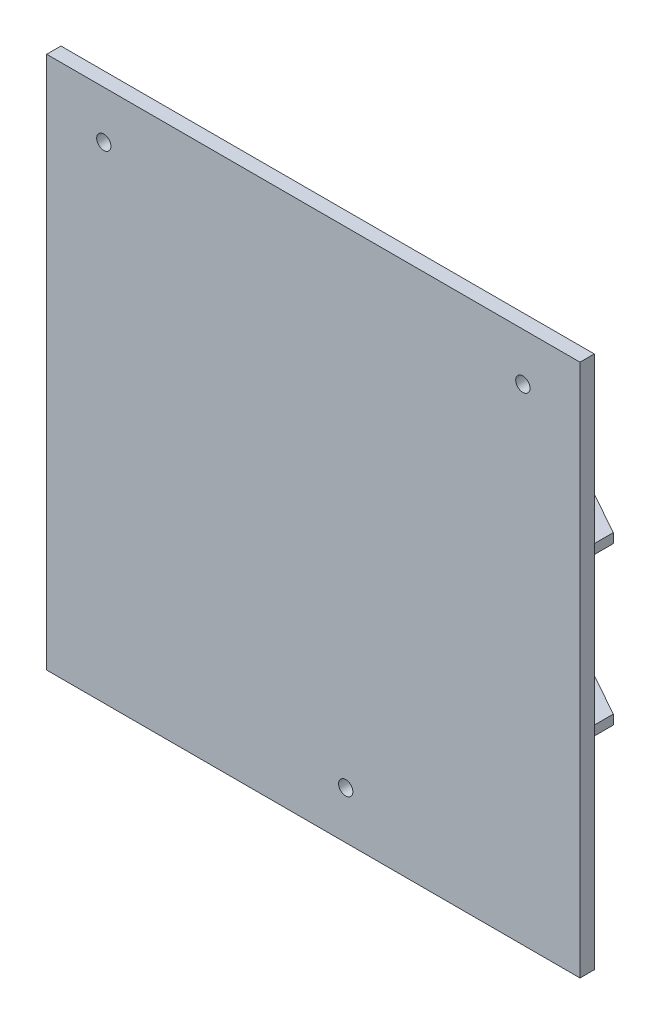
ISO-10303-21;
HEADER;
FILE_DESCRIPTION(('STEP AP214'),'2;1');
FILE_NAME('part.step','',(''),(''),'','','');
FILE_SCHEMA(('AUTOMOTIVE_DESIGN { 1 0 10303 214 1 1 1 1 }'));
ENDSEC;
DATA;
#1=APPLICATION_CONTEXT('core data for automotive mechanical design processes');
#2=APPLICATION_PROTOCOL_DEFINITION('international standard','automotive_design',2000,#1);
#3=PRODUCT_CONTEXT('',#1,'mechanical');
#4=PRODUCT('Part','Part','',(#3));
#5=PRODUCT_RELATED_PRODUCT_CATEGORY('part','',(#4));
#6=PRODUCT_DEFINITION_FORMATION('','',#4);
#7=PRODUCT_DEFINITION_CONTEXT('part definition',#1,'design');
#8=PRODUCT_DEFINITION('design','',#6,#7);
#9=PRODUCT_DEFINITION_SHAPE('','',#8);
#10=(LENGTH_UNIT() NAMED_UNIT(*) SI_UNIT(.MILLI.,.METRE.));
#11=(NAMED_UNIT(*) PLANE_ANGLE_UNIT() SI_UNIT($,.RADIAN.));
#12=(NAMED_UNIT(*) SI_UNIT($,.STERADIAN.) SOLID_ANGLE_UNIT());
#13=UNCERTAINTY_MEASURE_WITH_UNIT(LENGTH_MEASURE(1.E-05),#10,'distance_accuracy_value','');
#14=(GEOMETRIC_REPRESENTATION_CONTEXT(3) GLOBAL_UNCERTAINTY_ASSIGNED_CONTEXT((#13)) GLOBAL_UNIT_ASSIGNED_CONTEXT((#10,
#11,#12)) REPRESENTATION_CONTEXT('',''));
#15=CARTESIAN_POINT('',(0.,0.,0.));
#16=DIRECTION('',(0.,0.,1.));
#17=DIRECTION('',(1.,0.,0.));
#18=AXIS2_PLACEMENT_3D('',#15,#16,#17);
#19=CARTESIAN_POINT('',(0.,0.,-3.));
#20=DIRECTION('',(0.,0.,1.));
#21=DIRECTION('',(-1.,0.,0.));
#22=AXIS2_PLACEMENT_3D('',#19,#20,#21);
#23=PLANE('',#22);
#24=DIRECTION('',(0.,-1.,0.));
#25=VECTOR('',#24,1.);
#26=CARTESIAN_POINT('',(-49.1967650273224,-56.,-3.));
#27=LINE('',#26,#25);
#28=CARTESIAN_POINT('',(-49.1967650273224,-16.,-3.));
#29=VERTEX_POINT('',#28);
#30=CARTESIAN_POINT('',(-49.1967650273224,-56.,-3.));
#31=VERTEX_POINT('',#30);
#32=EDGE_CURVE('E188',#29,#31,#27,.T.);
#33=ORIENTED_EDGE('',*,*,#32,.T.);
#34=DIRECTION('',(1.,0.,0.));
#35=VECTOR('',#34,1.);
#36=CARTESIAN_POINT('',(-56.,-56.,-3.));
#37=LINE('',#36,#35);
#38=CARTESIAN_POINT('',(-56.,-56.,-3.));
#39=VERTEX_POINT('',#38);
#40=EDGE_CURVE('E238',#39,#31,#37,.T.);
#41=ORIENTED_EDGE('',*,*,#40,.F.);
#42=DIRECTION('',(0.,-1.,0.));
#43=VECTOR('',#42,1.);
#44=CARTESIAN_POINT('',(-56.,-56.,-3.));
#45=LINE('',#44,#43);
#46=CARTESIAN_POINT('',(-56.,56.,-3.));
#47=VERTEX_POINT('',#46);
#48=EDGE_CURVE('E234',#47,#39,#45,.T.);
#49=ORIENTED_EDGE('',*,*,#48,.F.);
#50=DIRECTION('',(-1.,0.,0.));
#51=VECTOR('',#50,1.);
#52=CARTESIAN_POINT('',(-56.,56.,-3.));
#53=LINE('',#52,#51);
#54=CARTESIAN_POINT('',(56.,56.,-3.));
#55=VERTEX_POINT('',#54);
#56=EDGE_CURVE('E230',#55,#47,#53,.T.);
#57=ORIENTED_EDGE('',*,*,#56,.F.);
#58=DIRECTION('',(0.,1.,0.));
#59=VECTOR('',#58,1.);
#60=CARTESIAN_POINT('',(56.,-56.,-3.));
#61=LINE('',#60,#59);
#62=CARTESIAN_POINT('',(56.,-56.,-3.));
#63=VERTEX_POINT('',#62);
#64=EDGE_CURVE('E227',#63,#55,#61,.T.);
#65=ORIENTED_EDGE('',*,*,#64,.F.);
#66=CARTESIAN_POINT('',(0.803234972677577,-56.,-3.));
#67=VERTEX_POINT('',#66);
#68=EDGE_CURVE('E237',#67,#63,#37,.T.);
#69=ORIENTED_EDGE('',*,*,#68,.F.);
#70=DIRECTION('',(0.,1.,0.));
#71=VECTOR('',#70,1.);
#72=CARTESIAN_POINT('',(0.803234972677577,-56.,-3.));
#73=LINE('',#72,#71);
#74=CARTESIAN_POINT('',(0.803234972677577,-16.,-3.));
#75=VERTEX_POINT('',#74);
#76=EDGE_CURVE('E214',#67,#75,#73,.T.);
#77=ORIENTED_EDGE('',*,*,#76,.T.);
#78=DIRECTION('',(-1.,0.,0.));
#79=VECTOR('',#78,1.);
#80=CARTESIAN_POINT('',(-49.1967650273224,-16.,-3.));
#81=LINE('',#80,#79);
#82=EDGE_CURVE('E203',#75,#29,#81,.T.);
#83=ORIENTED_EDGE('',*,*,#82,.T.);
#84=EDGE_LOOP('',(#33,#41,#49,#57,#65,#69,#77,#83));
#85=FACE_BOUND('',#84,.T.);
#86=CARTESIAN_POINT('',(6.80323497267758,-46.,-3.));
#87=DIRECTION('',(0.,0.,1.));
#88=DIRECTION('',(1.,0.,0.));
#89=AXIS2_PLACEMENT_3D('',#86,#87,#88);
#90=CIRCLE('',#89,1.5);
#91=CARTESIAN_POINT('',(8.30323497267758,-46.,-3.));
#92=VERTEX_POINT('',#91);
#93=EDGE_CURVE('E179',#92,#92,#90,.T.);
#94=ORIENTED_EDGE('',*,*,#93,.T.);
#95=EDGE_LOOP('',(#94));
#96=FACE_BOUND('',#95,.T.);
#97=CARTESIAN_POINT('',(44.,46.,-3.));
#98=DIRECTION('',(0.,0.,1.));
#99=DIRECTION('',(1.,0.,0.));
#100=AXIS2_PLACEMENT_3D('',#97,#98,#99);
#101=CIRCLE('',#100,1.5);
#102=CARTESIAN_POINT('',(45.5,46.,-3.));
#103=VERTEX_POINT('',#102);
#104=EDGE_CURVE('E192',#103,#103,#101,.T.);
#105=ORIENTED_EDGE('',*,*,#104,.T.);
#106=EDGE_LOOP('',(#105));
#107=FACE_BOUND('',#106,.T.);
#108=CARTESIAN_POINT('',(-44.,46.,-3.));
#109=DIRECTION('',(0.,0.,1.));
#110=DIRECTION('',(1.,0.,0.));
#111=AXIS2_PLACEMENT_3D('',#108,#109,#110);
#112=CIRCLE('',#111,1.5);
#113=CARTESIAN_POINT('',(-42.5,46.,-3.));
#114=VERTEX_POINT('',#113);
#115=EDGE_CURVE('E185',#114,#114,#112,.T.);
#116=ORIENTED_EDGE('',*,*,#115,.T.);
#117=EDGE_LOOP('',(#116));
#118=FACE_BOUND('',#117,.T.);
#119=DIRECTION('',(0.,1.,0.));
#120=VECTOR('',#119,1.);
#121=CARTESIAN_POINT('',(52.,-17.5,-3.));
#122=LINE('',#121,#120);
#123=CARTESIAN_POINT('',(52.,-17.5,-3.));
#124=VERTEX_POINT('',#123);
#125=CARTESIAN_POINT('',(52.,17.5,-3.));
#126=VERTEX_POINT('',#125);
#127=EDGE_CURVE('E494',#124,#126,#122,.T.);
#128=ORIENTED_EDGE('',*,*,#127,.T.);
#129=DIRECTION('',(-1.,0.,0.));
#130=VECTOR('',#129,1.);
#131=CARTESIAN_POINT('',(32.,17.5,-3.));
#132=LINE('',#131,#130);
#133=CARTESIAN_POINT('',(32.,17.5,-3.));
#134=VERTEX_POINT('',#133);
#135=EDGE_CURVE('E173',#126,#134,#132,.T.);
#136=ORIENTED_EDGE('',*,*,#135,.T.);
#137=DIRECTION('',(0.,-1.,0.));
#138=VECTOR('',#137,1.);
#139=CARTESIAN_POINT('',(32.,-17.5,-3.));
#140=LINE('',#139,#138);
#141=CARTESIAN_POINT('',(32.,-17.5,-3.));
#142=VERTEX_POINT('',#141);
#143=EDGE_CURVE('E505',#134,#142,#140,.T.);
#144=ORIENTED_EDGE('',*,*,#143,.T.);
#145=DIRECTION('',(1.,0.,0.));
#146=VECTOR('',#145,1.);
#147=CARTESIAN_POINT('',(32.,-17.5,-3.));
#148=LINE('',#147,#146);
#149=EDGE_CURVE('E502',#142,#124,#148,.T.);
#150=ORIENTED_EDGE('',*,*,#149,.T.);
#151=EDGE_LOOP('',(#128,#136,#144,#150));
#152=FACE_BOUND('',#151,.T.);
#153=ADVANCED_FACE('F35',(#85,#96,#107,#118,#152),#23,.F.);
#154=CARTESIAN_POINT('',(56.,-56.,-3.));
#155=DIRECTION('',(-1.,0.,0.));
#156=DIRECTION('',(0.,0.,-1.));
#157=AXIS2_PLACEMENT_3D('',#154,#155,#156);
#158=PLANE('',#157);
#159=DIRECTION('',(0.,1.,0.));
#160=VECTOR('',#159,1.);
#161=CARTESIAN_POINT('',(56.,-56.,0.));
#162=LINE('',#161,#160);
#163=CARTESIAN_POINT('',(56.,-56.,0.));
#164=VERTEX_POINT('',#163);
#165=CARTESIAN_POINT('',(56.,56.,0.));
#166=VERTEX_POINT('',#165);
#167=EDGE_CURVE('E226',#164,#166,#162,.T.);
#168=ORIENTED_EDGE('',*,*,#167,.F.);
#169=DIRECTION('',(0.,0.,1.));
#170=VECTOR('',#169,1.);
#171=CARTESIAN_POINT('',(56.,-56.,-3.));
#172=LINE('',#171,#170);
#173=EDGE_CURVE('E241',#63,#164,#172,.T.);
#174=ORIENTED_EDGE('',*,*,#173,.F.);
#175=ORIENTED_EDGE('',*,*,#64,.T.);
#176=DIRECTION('',(0.,0.,1.));
#177=VECTOR('',#176,1.);
#178=CARTESIAN_POINT('',(56.,56.,-3.));
#179=LINE('',#178,#177);
#180=EDGE_CURVE('E43',#55,#166,#179,.T.);
#181=ORIENTED_EDGE('',*,*,#180,.T.);
#182=EDGE_LOOP('',(#168,#174,#175,#181));
#183=FACE_BOUND('',#182,.T.);
#184=ADVANCED_FACE('F37',(#183),#158,.F.);
#185=CARTESIAN_POINT('',(-56.,56.,-3.));
#186=DIRECTION('',(0.,-1.,0.));
#187=DIRECTION('',(0.,0.,1.));
#188=AXIS2_PLACEMENT_3D('',#185,#186,#187);
#189=PLANE('',#188);
#190=DIRECTION('',(-1.,0.,0.));
#191=VECTOR('',#190,1.);
#192=CARTESIAN_POINT('',(-56.,56.,0.));
#193=LINE('',#192,#191);
#194=CARTESIAN_POINT('',(-56.,56.,0.));
#195=VERTEX_POINT('',#194);
#196=EDGE_CURVE('E244',#166,#195,#193,.T.);
#197=ORIENTED_EDGE('',*,*,#196,.F.);
#198=ORIENTED_EDGE('',*,*,#180,.F.);
#199=ORIENTED_EDGE('',*,*,#56,.T.);
#200=DIRECTION('',(0.,0.,1.));
#201=VECTOR('',#200,1.);
#202=CARTESIAN_POINT('',(-56.,56.,-3.));
#203=LINE('',#202,#201);
#204=EDGE_CURVE('E256',#47,#195,#203,.T.);
#205=ORIENTED_EDGE('',*,*,#204,.T.);
#206=EDGE_LOOP('',(#197,#198,#199,#205));
#207=FACE_BOUND('',#206,.T.);
#208=ADVANCED_FACE('F276',(#207),#189,.F.);
#209=CARTESIAN_POINT('',(-56.,-56.,-3.));
#210=DIRECTION('',(1.,0.,0.));
#211=DIRECTION('',(0.,0.,1.));
#212=AXIS2_PLACEMENT_3D('',#209,#210,#211);
#213=PLANE('',#212);
#214=DIRECTION('',(0.,-1.,0.));
#215=VECTOR('',#214,1.);
#216=CARTESIAN_POINT('',(-56.,-56.,0.));
#217=LINE('',#216,#215);
#218=CARTESIAN_POINT('',(-56.,-56.,0.));
#219=VERTEX_POINT('',#218);
#220=EDGE_CURVE('E247',#195,#219,#217,.T.);
#221=ORIENTED_EDGE('',*,*,#220,.F.);
#222=ORIENTED_EDGE('',*,*,#204,.F.);
#223=ORIENTED_EDGE('',*,*,#48,.T.);
#224=DIRECTION('',(0.,0.,1.));
#225=VECTOR('',#224,1.);
#226=CARTESIAN_POINT('',(-56.,-56.,-3.));
#227=LINE('',#226,#225);
#228=EDGE_CURVE('E253',#39,#219,#227,.T.);
#229=ORIENTED_EDGE('',*,*,#228,.T.);
#230=EDGE_LOOP('',(#221,#222,#223,#229));
#231=FACE_BOUND('',#230,.T.);
#232=ADVANCED_FACE('F278',(#231),#213,.F.);
#233=CARTESIAN_POINT('',(-56.,-56.,-3.));
#234=DIRECTION('',(0.,1.,0.));
#235=DIRECTION('',(-1.,0.,0.));
#236=AXIS2_PLACEMENT_3D('',#233,#234,#235);
#237=PLANE('',#236);
#238=DIRECTION('',(1.,0.,0.));
#239=VECTOR('',#238,1.);
#240=CARTESIAN_POINT('',(-56.,-56.,0.));
#241=LINE('',#240,#239);
#242=EDGE_CURVE('E231',#219,#164,#241,.T.);
#243=ORIENTED_EDGE('',*,*,#242,.F.);
#244=ORIENTED_EDGE('',*,*,#228,.F.);
#245=ORIENTED_EDGE('',*,*,#40,.T.);
#246=DIRECTION('',(0.,0.,1.));
#247=VECTOR('',#246,1.);
#248=CARTESIAN_POINT('',(-49.1967650273224,-56.,-35.));
#249=LINE('',#248,#247);
#250=CARTESIAN_POINT('',(-49.1967650273224,-56.,-35.));
#251=VERTEX_POINT('',#250);
#252=EDGE_CURVE('E224',#251,#31,#249,.T.);
#253=ORIENTED_EDGE('',*,*,#252,.F.);
#254=DIRECTION('',(1.,0.,0.));
#255=VECTOR('',#254,1.);
#256=CARTESIAN_POINT('',(-49.1967650273224,-56.,-35.));
#257=LINE('',#256,#255);
#258=CARTESIAN_POINT('',(0.803234972677577,-56.,-35.));
#259=VERTEX_POINT('',#258);
#260=EDGE_CURVE('E202',#251,#259,#257,.T.);
#261=ORIENTED_EDGE('',*,*,#260,.T.);
#262=DIRECTION('',(0.,0.,1.));
#263=VECTOR('',#262,1.);
#264=CARTESIAN_POINT('',(0.803234972677577,-56.,-35.));
#265=LINE('',#264,#263);
#266=EDGE_CURVE('E222',#259,#67,#265,.T.);
#267=ORIENTED_EDGE('',*,*,#266,.T.);
#268=ORIENTED_EDGE('',*,*,#68,.T.);
#269=ORIENTED_EDGE('',*,*,#173,.T.);
#270=EDGE_LOOP('',(#243,#244,#245,#253,#261,#267,#268,#269));
#271=FACE_BOUND('',#270,.T.);
#272=ADVANCED_FACE('F268',(#271),#237,.F.);
#273=CARTESIAN_POINT('',(0.,0.,0.));
#274=DIRECTION('',(0.,0.,1.));
#275=DIRECTION('',(-1.,0.,0.));
#276=AXIS2_PLACEMENT_3D('',#273,#274,#275);
#277=PLANE('',#276);
#278=CARTESIAN_POINT('',(-44.,46.,0.));
#279=DIRECTION('',(0.,0.,-1.));
#280=DIRECTION('',(-1.,0.,0.));
#281=AXIS2_PLACEMENT_3D('',#278,#279,#280);
#282=CIRCLE('',#281,1.5);
#283=CARTESIAN_POINT('',(-42.5,46.,0.));
#284=VERTEX_POINT('',#283);
#285=EDGE_CURVE('E189',#284,#284,#282,.F.);
#286=ORIENTED_EDGE('',*,*,#285,.F.);
#287=EDGE_LOOP('',(#286));
#288=FACE_BOUND('',#287,.T.);
#289=CARTESIAN_POINT('',(44.,46.,0.));
#290=DIRECTION('',(0.,0.,-1.));
#291=DIRECTION('',(-1.,0.,0.));
#292=AXIS2_PLACEMENT_3D('',#289,#290,#291);
#293=CIRCLE('',#292,1.5);
#294=CARTESIAN_POINT('',(45.5,46.,0.));
#295=VERTEX_POINT('',#294);
#296=EDGE_CURVE('E195',#295,#295,#293,.F.);
#297=ORIENTED_EDGE('',*,*,#296,.F.);
#298=EDGE_LOOP('',(#297));
#299=FACE_BOUND('',#298,.T.);
#300=CARTESIAN_POINT('',(6.80323497267758,-46.,0.));
#301=DIRECTION('',(0.,0.,-1.));
#302=DIRECTION('',(-1.,0.,0.));
#303=AXIS2_PLACEMENT_3D('',#300,#301,#302);
#304=CIRCLE('',#303,1.5);
#305=CARTESIAN_POINT('',(8.30323497267758,-46.,0.));
#306=VERTEX_POINT('',#305);
#307=EDGE_CURVE('E175',#306,#306,#304,.F.);
#308=ORIENTED_EDGE('',*,*,#307,.F.);
#309=EDGE_LOOP('',(#308));
#310=FACE_BOUND('',#309,.T.);
#311=ORIENTED_EDGE('',*,*,#167,.T.);
#312=ORIENTED_EDGE('',*,*,#196,.T.);
#313=ORIENTED_EDGE('',*,*,#220,.T.);
#314=ORIENTED_EDGE('',*,*,#242,.T.);
#315=EDGE_LOOP('',(#311,#312,#313,#314));
#316=FACE_BOUND('',#315,.T.);
#317=ADVANCED_FACE('F265',(#288,#299,#310,#316),#277,.T.);
#318=CARTESIAN_POINT('',(-49.1967650273224,-56.,-35.));
#319=DIRECTION('',(1.,0.,0.));
#320=DIRECTION('',(0.,0.,1.));
#321=AXIS2_PLACEMENT_3D('',#318,#319,#320);
#322=PLANE('',#321);
#323=ORIENTED_EDGE('',*,*,#32,.F.);
#324=DIRECTION('',(0.,0.,1.));
#325=VECTOR('',#324,1.);
#326=CARTESIAN_POINT('',(-49.1967650273224,-16.,-35.));
#327=LINE('',#326,#325);
#328=CARTESIAN_POINT('',(-49.1967650273224,-16.,-35.));
#329=VERTEX_POINT('',#328);
#330=EDGE_CURVE('E211',#329,#29,#327,.T.);
#331=ORIENTED_EDGE('',*,*,#330,.F.);
#332=DIRECTION('',(0.,-1.,0.));
#333=VECTOR('',#332,1.);
#334=CARTESIAN_POINT('',(-49.1967650273224,-56.,-35.));
#335=LINE('',#334,#333);
#336=EDGE_CURVE('E200',#329,#251,#335,.T.);
#337=ORIENTED_EDGE('',*,*,#336,.T.);
#338=ORIENTED_EDGE('',*,*,#252,.T.);
#339=EDGE_LOOP('',(#323,#331,#337,#338));
#340=FACE_BOUND('',#339,.T.);
#341=ADVANCED_FACE('F284',(#340),#322,.F.);
#342=CARTESIAN_POINT('',(0.803234972677577,-56.,-35.));
#343=DIRECTION('',(-1.,0.,0.));
#344=DIRECTION('',(0.,0.,-1.));
#345=AXIS2_PLACEMENT_3D('',#342,#343,#344);
#346=PLANE('',#345);
#347=ORIENTED_EDGE('',*,*,#76,.F.);
#348=ORIENTED_EDGE('',*,*,#266,.F.);
#349=DIRECTION('',(0.,1.,0.));
#350=VECTOR('',#349,1.);
#351=CARTESIAN_POINT('',(0.803234972677577,-56.,-35.));
#352=LINE('',#351,#350);
#353=CARTESIAN_POINT('',(0.803234972677577,-16.,-35.));
#354=VERTEX_POINT('',#353);
#355=EDGE_CURVE('E206',#259,#354,#352,.T.);
#356=ORIENTED_EDGE('',*,*,#355,.T.);
#357=DIRECTION('',(0.,0.,1.));
#358=VECTOR('',#357,1.);
#359=CARTESIAN_POINT('',(0.803234972677577,-16.,-35.));
#360=LINE('',#359,#358);
#361=EDGE_CURVE('E220',#354,#75,#360,.T.);
#362=ORIENTED_EDGE('',*,*,#361,.T.);
#363=EDGE_LOOP('',(#347,#348,#356,#362));
#364=FACE_BOUND('',#363,.T.);
#365=ADVANCED_FACE('F291',(#364),#346,.F.);
#366=CARTESIAN_POINT('',(-49.1967650273224,-16.,-35.));
#367=DIRECTION('',(0.,-1.,0.));
#368=DIRECTION('',(0.,0.,1.));
#369=AXIS2_PLACEMENT_3D('',#366,#367,#368);
#370=PLANE('',#369);
#371=ORIENTED_EDGE('',*,*,#82,.F.);
#372=ORIENTED_EDGE('',*,*,#361,.F.);
#373=DIRECTION('',(-1.,0.,0.));
#374=VECTOR('',#373,1.);
#375=CARTESIAN_POINT('',(-49.1967650273224,-16.,-35.));
#376=LINE('',#375,#374);
#377=EDGE_CURVE('E209',#354,#329,#376,.T.);
#378=ORIENTED_EDGE('',*,*,#377,.T.);
#379=ORIENTED_EDGE('',*,*,#330,.T.);
#380=EDGE_LOOP('',(#371,#372,#378,#379));
#381=FACE_BOUND('',#380,.T.);
#382=ADVANCED_FACE('F293',(#381),#370,.F.);
#383=CARTESIAN_POINT('',(0.,0.,-35.));
#384=DIRECTION('',(0.,0.,1.));
#385=DIRECTION('',(-1.,0.,0.));
#386=AXIS2_PLACEMENT_3D('',#383,#384,#385);
#387=PLANE('',#386);
#388=ORIENTED_EDGE('',*,*,#336,.F.);
#389=ORIENTED_EDGE('',*,*,#377,.F.);
#390=ORIENTED_EDGE('',*,*,#355,.F.);
#391=ORIENTED_EDGE('',*,*,#260,.F.);
#392=EDGE_LOOP('',(#388,#389,#390,#391));
#393=FACE_BOUND('',#392,.T.);
#394=ADVANCED_FACE('F288',(#393),#387,.F.);
#395=CARTESIAN_POINT('',(6.80323497267758,-46.,0.00100000000000013));
#396=DIRECTION('',(0.,0.,-1.));
#397=DIRECTION('',(1.,0.,0.));
#398=AXIS2_PLACEMENT_3D('',#395,#396,#397);
#399=CYLINDRICAL_SURFACE('',#398,1.5);
#400=CARTESIAN_POINT('',(8.30323497267758,-46.,0.));
#401=CARTESIAN_POINT('',(8.30323497267758,-46.,-0.03125));
#402=CARTESIAN_POINT('',(8.30323497267758,-46.,-0.0625));
#403=CARTESIAN_POINT('',(8.30323497267758,-46.,-0.125));
#404=CARTESIAN_POINT('',(8.30323497267758,-46.,-0.15625));
#405=CARTESIAN_POINT('',(8.30323497267758,-46.,-0.21875));
#406=CARTESIAN_POINT('',(8.30323497267758,-46.,-0.25));
#407=CARTESIAN_POINT('',(8.30323497267758,-46.,-0.3125));
#408=CARTESIAN_POINT('',(8.30323497267758,-46.,-0.34375));
#409=CARTESIAN_POINT('',(8.30323497267758,-46.,-0.40625));
#410=CARTESIAN_POINT('',(8.30323497267758,-46.,-0.4375));
#411=CARTESIAN_POINT('',(8.30323497267758,-46.,-0.5));
#412=CARTESIAN_POINT('',(8.30323497267758,-46.,-0.53125));
#413=CARTESIAN_POINT('',(8.30323497267758,-46.,-0.59375));
#414=CARTESIAN_POINT('',(8.30323497267758,-46.,-0.625));
#415=CARTESIAN_POINT('',(8.30323497267758,-46.,-0.6875));
#416=CARTESIAN_POINT('',(8.30323497267758,-46.,-0.71875));
#417=CARTESIAN_POINT('',(8.30323497267758,-46.,-0.78125));
#418=CARTESIAN_POINT('',(8.30323497267758,-46.,-0.8125));
#419=CARTESIAN_POINT('',(8.30323497267758,-46.,-0.875));
#420=CARTESIAN_POINT('',(8.30323497267758,-46.,-0.90625));
#421=CARTESIAN_POINT('',(8.30323497267758,-46.,-0.96875));
#422=CARTESIAN_POINT('',(8.30323497267758,-46.,-1.));
#423=CARTESIAN_POINT('',(8.30323497267758,-46.,-1.0625));
#424=CARTESIAN_POINT('',(8.30323497267758,-46.,-1.09375));
#425=CARTESIAN_POINT('',(8.30323497267758,-46.,-1.15625));
#426=CARTESIAN_POINT('',(8.30323497267758,-46.,-1.1875));
#427=CARTESIAN_POINT('',(8.30323497267758,-46.,-1.25));
#428=CARTESIAN_POINT('',(8.30323497267758,-46.,-1.28125));
#429=CARTESIAN_POINT('',(8.30323497267758,-46.,-1.34375));
#430=CARTESIAN_POINT('',(8.30323497267758,-46.,-1.375));
#431=CARTESIAN_POINT('',(8.30323497267758,-46.,-1.4375));
#432=CARTESIAN_POINT('',(8.30323497267758,-46.,-1.46875));
#433=CARTESIAN_POINT('',(8.30323497267758,-46.,-1.53125));
#434=CARTESIAN_POINT('',(8.30323497267758,-46.,-1.5625));
#435=CARTESIAN_POINT('',(8.30323497267758,-46.,-1.625));
#436=CARTESIAN_POINT('',(8.30323497267758,-46.,-1.65625));
#437=CARTESIAN_POINT('',(8.30323497267758,-46.,-1.71875));
#438=CARTESIAN_POINT('',(8.30323497267758,-46.,-1.75));
#439=CARTESIAN_POINT('',(8.30323497267758,-46.,-1.8125));
#440=CARTESIAN_POINT('',(8.30323497267758,-46.,-1.84375));
#441=CARTESIAN_POINT('',(8.30323497267758,-46.,-1.90625));
#442=CARTESIAN_POINT('',(8.30323497267758,-46.,-1.9375));
#443=CARTESIAN_POINT('',(8.30323497267758,-46.,-2.));
#444=CARTESIAN_POINT('',(8.30323497267758,-46.,-2.03125));
#445=CARTESIAN_POINT('',(8.30323497267758,-46.,-2.09375));
#446=CARTESIAN_POINT('',(8.30323497267758,-46.,-2.125));
#447=CARTESIAN_POINT('',(8.30323497267758,-46.,-2.1875));
#448=CARTESIAN_POINT('',(8.30323497267758,-46.,-2.21875));
#449=CARTESIAN_POINT('',(8.30323497267758,-46.,-2.28125));
#450=CARTESIAN_POINT('',(8.30323497267758,-46.,-2.3125));
#451=CARTESIAN_POINT('',(8.30323497267758,-46.,-2.375));
#452=CARTESIAN_POINT('',(8.30323497267758,-46.,-2.40625));
#453=CARTESIAN_POINT('',(8.30323497267758,-46.,-2.46875));
#454=CARTESIAN_POINT('',(8.30323497267758,-46.,-2.5));
#455=CARTESIAN_POINT('',(8.30323497267758,-46.,-2.5625));
#456=CARTESIAN_POINT('',(8.30323497267758,-46.,-2.59375));
#457=CARTESIAN_POINT('',(8.30323497267758,-46.,-2.65625));
#458=CARTESIAN_POINT('',(8.30323497267758,-46.,-2.6875));
#459=CARTESIAN_POINT('',(8.30323497267758,-46.,-2.75));
#460=CARTESIAN_POINT('',(8.30323497267758,-46.,-2.78125));
#461=CARTESIAN_POINT('',(8.30323497267758,-46.,-2.84375));
#462=CARTESIAN_POINT('',(8.30323497267758,-46.,-2.875));
#463=CARTESIAN_POINT('',(8.30323497267758,-46.,-2.9375));
#464=CARTESIAN_POINT('',(8.30323497267758,-46.,-2.96875));
#465=CARTESIAN_POINT('',(8.30323497267758,-46.,-3.));
#466=B_SPLINE_CURVE_WITH_KNOTS('',3,(#400,#401,#402,#403,#404,#405,#406,#407,#408,#409,#410,
#411,#412,#413,#414,#415,#416,#417,#418,#419,#420,#421,#422,#423,#424,#425,#426,#427,#428,#429,
#430,#431,#432,#433,#434,#435,#436,#437,#438,#439,#440,#441,#442,#443,#444,#445,#446,#447,#448,
#449,#450,#451,#452,#453,#454,#455,#456,#457,#458,#459,#460,#461,#462,#463,#464,#465),
.UNSPECIFIED.,.F.,.F.,(4,2,2,2,2,2,2,2,2,2,2,2,2,2,2,2,2,2,2,2,2,2,2,2,2,2,2,2,2,2,2,2,4),(0.,
0.09375,0.1875,0.28125,0.375,0.46875,0.5625,0.65625,0.75,0.84375,0.9375,1.03125,1.125,1.21875,
1.3125,1.40625,1.5,1.59375,1.6875,1.78125,1.875,1.96875,2.0625,2.15625,2.25,2.34375,2.4375,
2.53125,2.625,2.71875,2.8125,2.90625,3.),.UNSPECIFIED.);
#467=EDGE_CURVE('BSEAM300',#306,#92,#466,.T.);
#468=ORIENTED_EDGE('',*,*,#307,.T.);
#469=ORIENTED_EDGE('',*,*,#93,.F.);
#470=ORIENTED_EDGE('',*,*,#467,.T.);
#471=ORIENTED_EDGE('',*,*,#467,.F.);
#472=EDGE_LOOP('',(#468,#470,#469,#471));
#473=FACE_BOUND('',#472,.T.);
#474=ADVANCED_FACE('F300',(#473),#399,.F.);
#475=CARTESIAN_POINT('',(44.,46.,0.00100000000000013));
#476=DIRECTION('',(0.,0.,-1.));
#477=DIRECTION('',(1.,0.,0.));
#478=AXIS2_PLACEMENT_3D('',#475,#476,#477);
#479=CYLINDRICAL_SURFACE('',#478,1.5);
#480=CARTESIAN_POINT('',(45.5,46.,0.));
#481=CARTESIAN_POINT('',(45.5,46.,-0.03125));
#482=CARTESIAN_POINT('',(45.5,46.,-0.0625));
#483=CARTESIAN_POINT('',(45.5,46.,-0.125));
#484=CARTESIAN_POINT('',(45.5,46.,-0.15625));
#485=CARTESIAN_POINT('',(45.5,46.,-0.21875));
#486=CARTESIAN_POINT('',(45.5,46.,-0.25));
#487=CARTESIAN_POINT('',(45.5,46.,-0.3125));
#488=CARTESIAN_POINT('',(45.5,46.,-0.34375));
#489=CARTESIAN_POINT('',(45.5,46.,-0.40625));
#490=CARTESIAN_POINT('',(45.5,46.,-0.4375));
#491=CARTESIAN_POINT('',(45.5,46.,-0.5));
#492=CARTESIAN_POINT('',(45.5,46.,-0.53125));
#493=CARTESIAN_POINT('',(45.5,46.,-0.59375));
#494=CARTESIAN_POINT('',(45.5,46.,-0.625));
#495=CARTESIAN_POINT('',(45.5,46.,-0.6875));
#496=CARTESIAN_POINT('',(45.5,46.,-0.71875));
#497=CARTESIAN_POINT('',(45.5,46.,-0.78125));
#498=CARTESIAN_POINT('',(45.5,46.,-0.8125));
#499=CARTESIAN_POINT('',(45.5,46.,-0.875));
#500=CARTESIAN_POINT('',(45.5,46.,-0.90625));
#501=CARTESIAN_POINT('',(45.5,46.,-0.96875));
#502=CARTESIAN_POINT('',(45.5,46.,-1.));
#503=CARTESIAN_POINT('',(45.5,46.,-1.0625));
#504=CARTESIAN_POINT('',(45.5,46.,-1.09375));
#505=CARTESIAN_POINT('',(45.5,46.,-1.15625));
#506=CARTESIAN_POINT('',(45.5,46.,-1.1875));
#507=CARTESIAN_POINT('',(45.5,46.,-1.25));
#508=CARTESIAN_POINT('',(45.5,46.,-1.28125));
#509=CARTESIAN_POINT('',(45.5,46.,-1.34375));
#510=CARTESIAN_POINT('',(45.5,46.,-1.375));
#511=CARTESIAN_POINT('',(45.5,46.,-1.4375));
#512=CARTESIAN_POINT('',(45.5,46.,-1.46875));
#513=CARTESIAN_POINT('',(45.5,46.,-1.53125));
#514=CARTESIAN_POINT('',(45.5,46.,-1.5625));
#515=CARTESIAN_POINT('',(45.5,46.,-1.625));
#516=CARTESIAN_POINT('',(45.5,46.,-1.65625));
#517=CARTESIAN_POINT('',(45.5,46.,-1.71875));
#518=CARTESIAN_POINT('',(45.5,46.,-1.75));
#519=CARTESIAN_POINT('',(45.5,46.,-1.8125));
#520=CARTESIAN_POINT('',(45.5,46.,-1.84375));
#521=CARTESIAN_POINT('',(45.5,46.,-1.90625));
#522=CARTESIAN_POINT('',(45.5,46.,-1.9375));
#523=CARTESIAN_POINT('',(45.5,46.,-2.));
#524=CARTESIAN_POINT('',(45.5,46.,-2.03125));
#525=CARTESIAN_POINT('',(45.5,46.,-2.09375));
#526=CARTESIAN_POINT('',(45.5,46.,-2.125));
#527=CARTESIAN_POINT('',(45.5,46.,-2.1875));
#528=CARTESIAN_POINT('',(45.5,46.,-2.21875));
#529=CARTESIAN_POINT('',(45.5,46.,-2.28125));
#530=CARTESIAN_POINT('',(45.5,46.,-2.3125));
#531=CARTESIAN_POINT('',(45.5,46.,-2.375));
#532=CARTESIAN_POINT('',(45.5,46.,-2.40625));
#533=CARTESIAN_POINT('',(45.5,46.,-2.46875));
#534=CARTESIAN_POINT('',(45.5,46.,-2.5));
#535=CARTESIAN_POINT('',(45.5,46.,-2.5625));
#536=CARTESIAN_POINT('',(45.5,46.,-2.59375));
#537=CARTESIAN_POINT('',(45.5,46.,-2.65625));
#538=CARTESIAN_POINT('',(45.5,46.,-2.6875));
#539=CARTESIAN_POINT('',(45.5,46.,-2.75));
#540=CARTESIAN_POINT('',(45.5,46.,-2.78125));
#541=CARTESIAN_POINT('',(45.5,46.,-2.84375));
#542=CARTESIAN_POINT('',(45.5,46.,-2.875));
#543=CARTESIAN_POINT('',(45.5,46.,-2.9375));
#544=CARTESIAN_POINT('',(45.5,46.,-2.96875));
#545=CARTESIAN_POINT('',(45.5,46.,-3.));
#546=B_SPLINE_CURVE_WITH_KNOTS('',3,(#480,#481,#482,#483,#484,#485,#486,#487,#488,#489,#490,
#491,#492,#493,#494,#495,#496,#497,#498,#499,#500,#501,#502,#503,#504,#505,#506,#507,#508,#509,
#510,#511,#512,#513,#514,#515,#516,#517,#518,#519,#520,#521,#522,#523,#524,#525,#526,#527,#528,
#529,#530,#531,#532,#533,#534,#535,#536,#537,#538,#539,#540,#541,#542,#543,#544,#545),
.UNSPECIFIED.,.F.,.F.,(4,2,2,2,2,2,2,2,2,2,2,2,2,2,2,2,2,2,2,2,2,2,2,2,2,2,2,2,2,2,2,2,4),(0.,
0.09375,0.1875,0.28125,0.375,0.46875,0.5625,0.65625,0.75,0.84375,0.9375,1.03125,1.125,1.21875,
1.3125,1.40625,1.5,1.59375,1.6875,1.78125,1.875,1.96875,2.0625,2.15625,2.25,2.34375,2.4375,
2.53125,2.625,2.71875,2.8125,2.90625,3.),.UNSPECIFIED.);
#547=EDGE_CURVE('BSEAM361',#295,#103,#546,.T.);
#548=ORIENTED_EDGE('',*,*,#296,.T.);
#549=ORIENTED_EDGE('',*,*,#104,.F.);
#550=ORIENTED_EDGE('',*,*,#547,.T.);
#551=ORIENTED_EDGE('',*,*,#547,.F.);
#552=EDGE_LOOP('',(#548,#550,#549,#551));
#553=FACE_BOUND('',#552,.T.);
#554=ADVANCED_FACE('F361',(#553),#479,.F.);
#555=CARTESIAN_POINT('',(-44.,46.,0.00100000000000013));
#556=DIRECTION('',(0.,0.,-1.));
#557=DIRECTION('',(1.,0.,0.));
#558=AXIS2_PLACEMENT_3D('',#555,#556,#557);
#559=CYLINDRICAL_SURFACE('',#558,1.5);
#560=CARTESIAN_POINT('',(-42.5,46.,0.));
#561=CARTESIAN_POINT('',(-42.5,46.,-0.03125));
#562=CARTESIAN_POINT('',(-42.5,46.,-0.0625));
#563=CARTESIAN_POINT('',(-42.5,46.,-0.125));
#564=CARTESIAN_POINT('',(-42.5,46.,-0.15625));
#565=CARTESIAN_POINT('',(-42.5,46.,-0.21875));
#566=CARTESIAN_POINT('',(-42.5,46.,-0.25));
#567=CARTESIAN_POINT('',(-42.5,46.,-0.3125));
#568=CARTESIAN_POINT('',(-42.5,46.,-0.34375));
#569=CARTESIAN_POINT('',(-42.5,46.,-0.40625));
#570=CARTESIAN_POINT('',(-42.5,46.,-0.4375));
#571=CARTESIAN_POINT('',(-42.5,46.,-0.5));
#572=CARTESIAN_POINT('',(-42.5,46.,-0.53125));
#573=CARTESIAN_POINT('',(-42.5,46.,-0.59375));
#574=CARTESIAN_POINT('',(-42.5,46.,-0.625));
#575=CARTESIAN_POINT('',(-42.5,46.,-0.6875));
#576=CARTESIAN_POINT('',(-42.5,46.,-0.71875));
#577=CARTESIAN_POINT('',(-42.5,46.,-0.78125));
#578=CARTESIAN_POINT('',(-42.5,46.,-0.8125));
#579=CARTESIAN_POINT('',(-42.5,46.,-0.875));
#580=CARTESIAN_POINT('',(-42.5,46.,-0.90625));
#581=CARTESIAN_POINT('',(-42.5,46.,-0.96875));
#582=CARTESIAN_POINT('',(-42.5,46.,-1.));
#583=CARTESIAN_POINT('',(-42.5,46.,-1.0625));
#584=CARTESIAN_POINT('',(-42.5,46.,-1.09375));
#585=CARTESIAN_POINT('',(-42.5,46.,-1.15625));
#586=CARTESIAN_POINT('',(-42.5,46.,-1.1875));
#587=CARTESIAN_POINT('',(-42.5,46.,-1.25));
#588=CARTESIAN_POINT('',(-42.5,46.,-1.28125));
#589=CARTESIAN_POINT('',(-42.5,46.,-1.34375));
#590=CARTESIAN_POINT('',(-42.5,46.,-1.375));
#591=CARTESIAN_POINT('',(-42.5,46.,-1.4375));
#592=CARTESIAN_POINT('',(-42.5,46.,-1.46875));
#593=CARTESIAN_POINT('',(-42.5,46.,-1.53125));
#594=CARTESIAN_POINT('',(-42.5,46.,-1.5625));
#595=CARTESIAN_POINT('',(-42.5,46.,-1.625));
#596=CARTESIAN_POINT('',(-42.5,46.,-1.65625));
#597=CARTESIAN_POINT('',(-42.5,46.,-1.71875));
#598=CARTESIAN_POINT('',(-42.5,46.,-1.75));
#599=CARTESIAN_POINT('',(-42.5,46.,-1.8125));
#600=CARTESIAN_POINT('',(-42.5,46.,-1.84375));
#601=CARTESIAN_POINT('',(-42.5,46.,-1.90625));
#602=CARTESIAN_POINT('',(-42.5,46.,-1.9375));
#603=CARTESIAN_POINT('',(-42.5,46.,-2.));
#604=CARTESIAN_POINT('',(-42.5,46.,-2.03125));
#605=CARTESIAN_POINT('',(-42.5,46.,-2.09375));
#606=CARTESIAN_POINT('',(-42.5,46.,-2.125));
#607=CARTESIAN_POINT('',(-42.5,46.,-2.1875));
#608=CARTESIAN_POINT('',(-42.5,46.,-2.21875));
#609=CARTESIAN_POINT('',(-42.5,46.,-2.28125));
#610=CARTESIAN_POINT('',(-42.5,46.,-2.3125));
#611=CARTESIAN_POINT('',(-42.5,46.,-2.375));
#612=CARTESIAN_POINT('',(-42.5,46.,-2.40625));
#613=CARTESIAN_POINT('',(-42.5,46.,-2.46875));
#614=CARTESIAN_POINT('',(-42.5,46.,-2.5));
#615=CARTESIAN_POINT('',(-42.5,46.,-2.5625));
#616=CARTESIAN_POINT('',(-42.5,46.,-2.59375));
#617=CARTESIAN_POINT('',(-42.5,46.,-2.65625));
#618=CARTESIAN_POINT('',(-42.5,46.,-2.6875));
#619=CARTESIAN_POINT('',(-42.5,46.,-2.75));
#620=CARTESIAN_POINT('',(-42.5,46.,-2.78125));
#621=CARTESIAN_POINT('',(-42.5,46.,-2.84375));
#622=CARTESIAN_POINT('',(-42.5,46.,-2.875));
#623=CARTESIAN_POINT('',(-42.5,46.,-2.9375));
#624=CARTESIAN_POINT('',(-42.5,46.,-2.96875));
#625=CARTESIAN_POINT('',(-42.5,46.,-3.));
#626=B_SPLINE_CURVE_WITH_KNOTS('',3,(#560,#561,#562,#563,#564,#565,#566,#567,#568,#569,#570,
#571,#572,#573,#574,#575,#576,#577,#578,#579,#580,#581,#582,#583,#584,#585,#586,#587,#588,#589,
#590,#591,#592,#593,#594,#595,#596,#597,#598,#599,#600,#601,#602,#603,#604,#605,#606,#607,#608,
#609,#610,#611,#612,#613,#614,#615,#616,#617,#618,#619,#620,#621,#622,#623,#624,#625),
.UNSPECIFIED.,.F.,.F.,(4,2,2,2,2,2,2,2,2,2,2,2,2,2,2,2,2,2,2,2,2,2,2,2,2,2,2,2,2,2,2,2,4),(0.,
0.09375,0.1875,0.28125,0.375,0.46875,0.5625,0.65625,0.75,0.84375,0.9375,1.03125,1.125,1.21875,
1.3125,1.40625,1.5,1.59375,1.6875,1.78125,1.875,1.96875,2.0625,2.15625,2.25,2.34375,2.4375,
2.53125,2.625,2.71875,2.8125,2.90625,3.),.UNSPECIFIED.);
#627=EDGE_CURVE('BSEAM371',#284,#114,#626,.T.);
#628=ORIENTED_EDGE('',*,*,#285,.T.);
#629=ORIENTED_EDGE('',*,*,#115,.F.);
#630=ORIENTED_EDGE('',*,*,#627,.T.);
#631=ORIENTED_EDGE('',*,*,#627,.F.);
#632=EDGE_LOOP('',(#628,#630,#629,#631));
#633=FACE_BOUND('',#632,.T.);
#634=ADVANCED_FACE('F371',(#633),#559,.F.);
#635=CARTESIAN_POINT('',(52.,-17.5,-21.));
#636=DIRECTION('',(-1.,0.,0.));
#637=DIRECTION('',(0.,0.,-1.));
#638=AXIS2_PLACEMENT_3D('',#635,#636,#637);
#639=PLANE('',#638);
#640=DIRECTION('',(0.,0.,1.));
#641=VECTOR('',#640,1.);
#642=CARTESIAN_POINT('',(52.,17.5,-21.));
#643=LINE('',#642,#641);
#644=CARTESIAN_POINT('',(52.,17.5,-11.));
#645=VERTEX_POINT('',#644);
#646=EDGE_CURVE('E56',#645,#126,#643,.T.);
#647=ORIENTED_EDGE('',*,*,#646,.T.);
#648=ORIENTED_EDGE('',*,*,#127,.F.);
#649=DIRECTION('',(0.,0.,1.));
#650=VECTOR('',#649,1.);
#651=CARTESIAN_POINT('',(52.,-17.5,-21.));
#652=LINE('',#651,#650);
#653=CARTESIAN_POINT('',(52.,-17.5,-11.));
#654=VERTEX_POINT('',#653);
#655=EDGE_CURVE('E493',#654,#124,#652,.T.);
#656=ORIENTED_EDGE('',*,*,#655,.F.);
#657=DIRECTION('',(0.,1.,0.));
#658=VECTOR('',#657,1.);
#659=CARTESIAN_POINT('',(52.,-56.,-11.));
#660=LINE('',#659,#658);
#661=CARTESIAN_POINT('',(52.,-15.5,-11.));
#662=VERTEX_POINT('',#661);
#663=EDGE_CURVE('E169',#654,#662,#660,.T.);
#664=ORIENTED_EDGE('',*,*,#663,.T.);
#665=DIRECTION('',(0.,0.,-1.));
#666=VECTOR('',#665,1.);
#667=CARTESIAN_POINT('',(52.,-15.5,-5.));
#668=LINE('',#667,#666);
#669=CARTESIAN_POINT('',(52.,-15.5,-5.));
#670=VERTEX_POINT('',#669);
#671=EDGE_CURVE('E517',#670,#662,#668,.T.);
#672=ORIENTED_EDGE('',*,*,#671,.F.);
#673=DIRECTION('',(0.,1.,0.));
#674=VECTOR('',#673,1.);
#675=CARTESIAN_POINT('',(52.,0.,-5.));
#676=LINE('',#675,#674);
#677=CARTESIAN_POINT('',(52.,15.5,-5.));
#678=VERTEX_POINT('',#677);
#679=EDGE_CURVE('E528',#670,#678,#676,.T.);
#680=ORIENTED_EDGE('',*,*,#679,.T.);
#681=DIRECTION('',(0.,0.,-1.));
#682=VECTOR('',#681,1.);
#683=CARTESIAN_POINT('',(52.,15.5,-5.));
#684=LINE('',#683,#682);
#685=CARTESIAN_POINT('',(52.,15.5,-11.));
#686=VERTEX_POINT('',#685);
#687=EDGE_CURVE('E168',#678,#686,#684,.T.);
#688=ORIENTED_EDGE('',*,*,#687,.T.);
#689=EDGE_CURVE('E157',#686,#645,#660,.T.);
#690=ORIENTED_EDGE('',*,*,#689,.T.);
#691=EDGE_LOOP('',(#647,#648,#656,#664,#672,#680,#688,#690));
#692=FACE_BOUND('',#691,.T.);
#693=ADVANCED_FACE('F165',(#692),#639,.F.);
#694=CARTESIAN_POINT('',(32.,17.5,-21.));
#695=DIRECTION('',(0.,-1.,0.));
#696=DIRECTION('',(0.,0.,1.));
#697=AXIS2_PLACEMENT_3D('',#694,#695,#696);
#698=PLANE('',#697);
#699=DIRECTION('',(-1.,0.,0.));
#700=VECTOR('',#699,1.);
#701=CARTESIAN_POINT('',(32.,17.5,-21.));
#702=LINE('',#701,#700);
#703=CARTESIAN_POINT('',(34.,17.5,-21.));
#704=VERTEX_POINT('',#703);
#705=CARTESIAN_POINT('',(32.,17.5,-21.));
#706=VERTEX_POINT('',#705);
#707=EDGE_CURVE('E504',#704,#706,#702,.T.);
#708=ORIENTED_EDGE('',*,*,#707,.T.);
#709=DIRECTION('',(0.,0.,1.));
#710=VECTOR('',#709,1.);
#711=CARTESIAN_POINT('',(32.,17.5,-21.));
#712=LINE('',#711,#710);
#713=EDGE_CURVE('E176',#706,#134,#712,.T.);
#714=ORIENTED_EDGE('',*,*,#713,.T.);
#715=ORIENTED_EDGE('',*,*,#135,.F.);
#716=ORIENTED_EDGE('',*,*,#646,.F.);
#717=DIRECTION('',(-0.874157276121538,0.,-0.485642931178632));
#718=VECTOR('',#717,1.);
#719=CARTESIAN_POINT('',(34.,17.5,-21.));
#720=LINE('',#719,#718);
#721=EDGE_CURVE('E155',#645,#704,#720,.T.);
#722=ORIENTED_EDGE('',*,*,#721,.T.);
#723=EDGE_LOOP('',(#708,#714,#715,#716,#722));
#724=FACE_BOUND('',#723,.T.);
#725=ADVANCED_FACE('F171',(#724),#698,.F.);
#726=CARTESIAN_POINT('',(32.,-17.5,-21.));
#727=DIRECTION('',(1.,0.,0.));
#728=DIRECTION('',(0.,0.,1.));
#729=AXIS2_PLACEMENT_3D('',#726,#727,#728);
#730=PLANE('',#729);
#731=ORIENTED_EDGE('',*,*,#143,.F.);
#732=ORIENTED_EDGE('',*,*,#713,.F.);
#733=DIRECTION('',(0.,-1.,0.));
#734=VECTOR('',#733,1.);
#735=CARTESIAN_POINT('',(32.,-17.5,-21.));
#736=LINE('',#735,#734);
#737=CARTESIAN_POINT('',(32.,-17.5,-21.));
#738=VERTEX_POINT('',#737);
#739=EDGE_CURVE('E499',#706,#738,#736,.T.);
#740=ORIENTED_EDGE('',*,*,#739,.T.);
#741=DIRECTION('',(0.,0.,1.));
#742=VECTOR('',#741,1.);
#743=CARTESIAN_POINT('',(32.,-17.5,-21.));
#744=LINE('',#743,#742);
#745=EDGE_CURVE('E181',#738,#142,#744,.T.);
#746=ORIENTED_EDGE('',*,*,#745,.T.);
#747=EDGE_LOOP('',(#731,#732,#740,#746));
#748=FACE_BOUND('',#747,.T.);
#749=ADVANCED_FACE('F398',(#748),#730,.F.);
#750=CARTESIAN_POINT('',(32.,-17.5,-21.));
#751=DIRECTION('',(0.,1.,0.));
#752=DIRECTION('',(0.,0.,-1.));
#753=AXIS2_PLACEMENT_3D('',#750,#751,#752);
#754=PLANE('',#753);
#755=ORIENTED_EDGE('',*,*,#655,.T.);
#756=ORIENTED_EDGE('',*,*,#149,.F.);
#757=ORIENTED_EDGE('',*,*,#745,.F.);
#758=DIRECTION('',(1.,0.,0.));
#759=VECTOR('',#758,1.);
#760=CARTESIAN_POINT('',(32.,-17.5,-21.));
#761=LINE('',#760,#759);
#762=CARTESIAN_POINT('',(34.,-17.5,-21.));
#763=VERTEX_POINT('',#762);
#764=EDGE_CURVE('E497',#738,#763,#761,.T.);
#765=ORIENTED_EDGE('',*,*,#764,.T.);
#766=DIRECTION('',(-0.874157276121538,0.,-0.485642931178632));
#767=VECTOR('',#766,1.);
#768=CARTESIAN_POINT('',(32.4716981132075,-17.5,-21.8490566037736));
#769=LINE('',#768,#767);
#770=EDGE_CURVE('E490',#654,#763,#769,.T.);
#771=ORIENTED_EDGE('',*,*,#770,.F.);
#772=EDGE_LOOP('',(#755,#756,#757,#765,#771));
#773=FACE_BOUND('',#772,.T.);
#774=ADVANCED_FACE('F407',(#773),#754,.F.);
#775=CARTESIAN_POINT('',(0.,0.,-21.));
#776=DIRECTION('',(0.,0.,1.));
#777=DIRECTION('',(-1.,0.,0.));
#778=AXIS2_PLACEMENT_3D('',#775,#776,#777);
#779=PLANE('',#778);
#780=ORIENTED_EDGE('',*,*,#764,.F.);
#781=ORIENTED_EDGE('',*,*,#739,.F.);
#782=ORIENTED_EDGE('',*,*,#707,.F.);
#783=DIRECTION('',(0.,1.,0.));
#784=VECTOR('',#783,1.);
#785=CARTESIAN_POINT('',(34.,-56.,-21.));
#786=LINE('',#785,#784);
#787=CARTESIAN_POINT('',(34.,15.5,-21.));
#788=VERTEX_POINT('',#787);
#789=EDGE_CURVE('E160',#788,#704,#786,.T.);
#790=ORIENTED_EDGE('',*,*,#789,.F.);
#791=DIRECTION('',(0.,-1.,0.));
#792=VECTOR('',#791,1.);
#793=CARTESIAN_POINT('',(34.,0.,-21.));
#794=LINE('',#793,#792);
#795=CARTESIAN_POINT('',(34.,-15.5,-21.));
#796=VERTEX_POINT('',#795);
#797=EDGE_CURVE('E523',#788,#796,#794,.T.);
#798=ORIENTED_EDGE('',*,*,#797,.T.);
#799=EDGE_CURVE('E536',#763,#796,#786,.T.);
#800=ORIENTED_EDGE('',*,*,#799,.F.);
#801=EDGE_LOOP('',(#780,#781,#782,#790,#798,#800));
#802=FACE_BOUND('',#801,.T.);
#803=ADVANCED_FACE('F417',(#802),#779,.F.);
#804=CARTESIAN_POINT('',(34.,0.,-5.));
#805=DIRECTION('',(-1.,0.,0.));
#806=DIRECTION('',(0.,-1.,0.));
#807=AXIS2_PLACEMENT_3D('',#804,#805,#806);
#808=PLANE('',#807);
#809=ORIENTED_EDGE('',*,*,#797,.F.);
#810=DIRECTION('',(0.,0.,-1.));
#811=VECTOR('',#810,1.);
#812=CARTESIAN_POINT('',(34.,15.5,-5.));
#813=LINE('',#812,#811);
#814=CARTESIAN_POINT('',(34.,15.5,-5.));
#815=VERTEX_POINT('',#814);
#816=EDGE_CURVE('E509',#815,#788,#813,.T.);
#817=ORIENTED_EDGE('',*,*,#816,.F.);
#818=DIRECTION('',(0.,-1.,0.));
#819=VECTOR('',#818,1.);
#820=CARTESIAN_POINT('',(34.,0.,-5.));
#821=LINE('',#820,#819);
#822=CARTESIAN_POINT('',(34.,-15.5,-5.));
#823=VERTEX_POINT('',#822);
#824=EDGE_CURVE('E526',#815,#823,#821,.T.);
#825=ORIENTED_EDGE('',*,*,#824,.T.);
#826=DIRECTION('',(0.,0.,-1.));
#827=VECTOR('',#826,1.);
#828=CARTESIAN_POINT('',(34.,-15.5,-5.));
#829=LINE('',#828,#827);
#830=EDGE_CURVE('E514',#823,#796,#829,.T.);
#831=ORIENTED_EDGE('',*,*,#830,.T.);
#832=EDGE_LOOP('',(#809,#817,#825,#831));
#833=FACE_BOUND('',#832,.T.);
#834=ADVANCED_FACE('F427',(#833),#808,.F.);
#835=CARTESIAN_POINT('',(0.,15.5,-5.));
#836=DIRECTION('',(0.,1.,0.));
#837=DIRECTION('',(-1.,0.,0.));
#838=AXIS2_PLACEMENT_3D('',#835,#836,#837);
#839=PLANE('',#838);
#840=ORIENTED_EDGE('',*,*,#687,.F.);
#841=DIRECTION('',(-1.,0.,0.));
#842=VECTOR('',#841,1.);
#843=CARTESIAN_POINT('',(0.,15.5,-5.));
#844=LINE('',#843,#842);
#845=EDGE_CURVE('E518',#678,#815,#844,.T.);
#846=ORIENTED_EDGE('',*,*,#845,.T.);
#847=ORIENTED_EDGE('',*,*,#816,.T.);
#848=DIRECTION('',(-0.874157276121538,0.,-0.485642931178632));
#849=VECTOR('',#848,1.);
#850=CARTESIAN_POINT('',(14.811320754717,15.5,-31.6603773584906));
#851=LINE('',#850,#849);
#852=EDGE_CURVE('E535',#686,#788,#851,.T.);
#853=ORIENTED_EDGE('',*,*,#852,.F.);
#854=EDGE_LOOP('',(#840,#846,#847,#853));
#855=FACE_BOUND('',#854,.T.);
#856=ADVANCED_FACE('F437',(#855),#839,.F.);
#857=CARTESIAN_POINT('',(0.,-15.5,-5.));
#858=DIRECTION('',(0.,-1.,0.));
#859=DIRECTION('',(1.,0.,0.));
#860=AXIS2_PLACEMENT_3D('',#857,#858,#859);
#861=PLANE('',#860);
#862=ORIENTED_EDGE('',*,*,#830,.F.);
#863=DIRECTION('',(1.,0.,0.));
#864=VECTOR('',#863,1.);
#865=CARTESIAN_POINT('',(0.,-15.5,-5.));
#866=LINE('',#865,#864);
#867=EDGE_CURVE('E530',#823,#670,#866,.T.);
#868=ORIENTED_EDGE('',*,*,#867,.T.);
#869=ORIENTED_EDGE('',*,*,#671,.T.);
#870=DIRECTION('',(0.874157276121538,0.,0.485642931178632));
#871=VECTOR('',#870,1.);
#872=CARTESIAN_POINT('',(14.811320754717,-15.5,-31.6603773584906));
#873=LINE('',#872,#871);
#874=EDGE_CURVE('E11',#796,#662,#873,.T.);
#875=ORIENTED_EDGE('',*,*,#874,.F.);
#876=EDGE_LOOP('',(#862,#868,#869,#875));
#877=FACE_BOUND('',#876,.T.);
#878=ADVANCED_FACE('F447',(#877),#861,.F.);
#879=CARTESIAN_POINT('',(0.,0.,-5.));
#880=DIRECTION('',(0.,0.,-1.));
#881=DIRECTION('',(1.,0.,0.));
#882=AXIS2_PLACEMENT_3D('',#879,#880,#881);
#883=PLANE('',#882);
#884=ORIENTED_EDGE('',*,*,#824,.F.);
#885=ORIENTED_EDGE('',*,*,#845,.F.);
#886=ORIENTED_EDGE('',*,*,#679,.F.);
#887=ORIENTED_EDGE('',*,*,#867,.F.);
#888=EDGE_LOOP('',(#884,#885,#886,#887));
#889=FACE_BOUND('',#888,.T.);
#890=ADVANCED_FACE('F457',(#889),#883,.T.);
#891=CARTESIAN_POINT('',(34.,-56.,-21.));
#892=DIRECTION('',(-0.485642931178632,0.,0.874157276121538));
#893=DIRECTION('',(-0.874157276121538,0.,-0.485642931178632));
#894=AXIS2_PLACEMENT_3D('',#891,#892,#893);
#895=PLANE('',#894);
#896=ORIENTED_EDGE('',*,*,#663,.F.);
#897=ORIENTED_EDGE('',*,*,#770,.T.);
#898=ORIENTED_EDGE('',*,*,#799,.T.);
#899=ORIENTED_EDGE('',*,*,#874,.T.);
#900=EDGE_LOOP('',(#896,#897,#898,#899));
#901=FACE_BOUND('',#900,.T.);
#902=ADVANCED_FACE('F467',(#901),#895,.F.);
#903=ORIENTED_EDGE('',*,*,#689,.F.);
#904=ORIENTED_EDGE('',*,*,#852,.T.);
#905=ORIENTED_EDGE('',*,*,#789,.T.);
#906=ORIENTED_EDGE('',*,*,#721,.F.);
#907=EDGE_LOOP('',(#903,#904,#905,#906));
#908=FACE_BOUND('',#907,.T.);
#909=ADVANCED_FACE('F156',(#908),#895,.F.);
#910=CLOSED_SHELL('',(#153,#184,#208,#232,#272,#317,#341,#365,#382,#394,#474,#554,#634,#693,
#725,#749,#774,#803,#834,#856,#878,#890,#902,#909));
#911=MANIFOLD_SOLID_BREP('B2',#910);
#912=ADVANCED_BREP_SHAPE_REPRESENTATION('',(#18,#911),#14);
#913=SHAPE_DEFINITION_REPRESENTATION(#9,#912);
ENDSEC;
END-ISO-10303-21;
